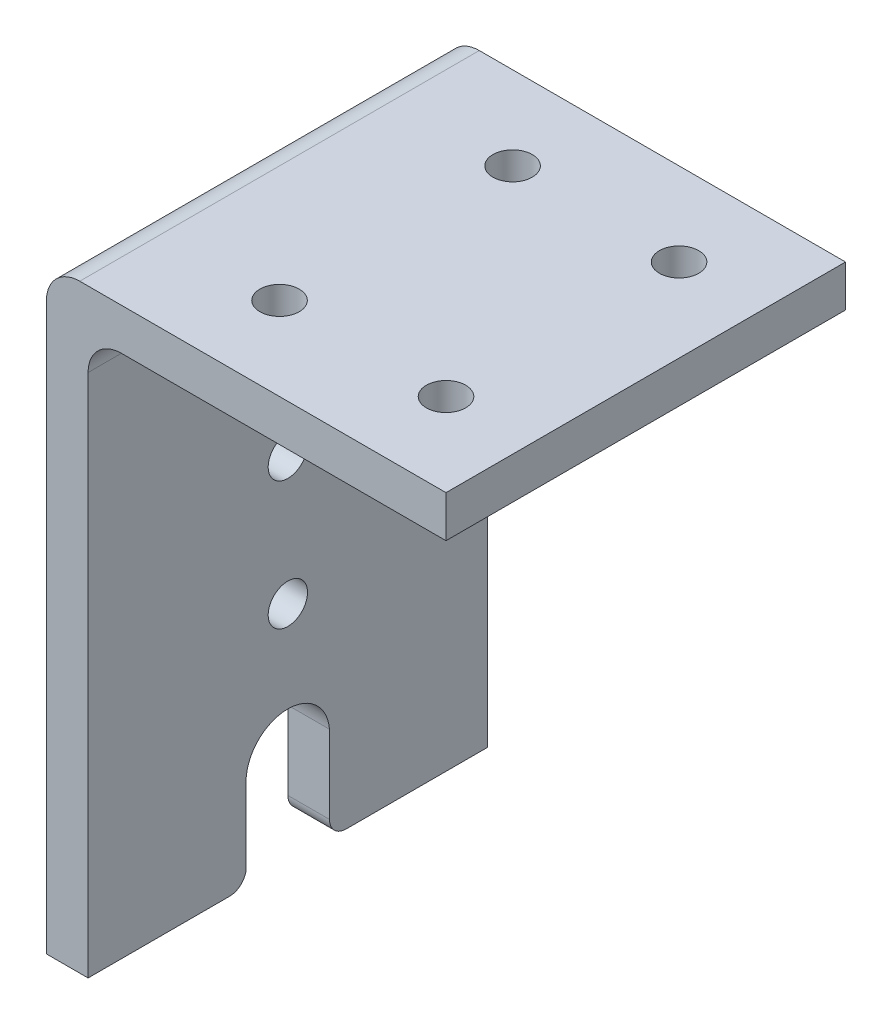
ISO-10303-21;
HEADER;
FILE_DESCRIPTION(('STEP AP214'),'2;1');
FILE_NAME('part.step','',(''),(''),'','','');
FILE_SCHEMA(('AUTOMOTIVE_DESIGN { 1 0 10303 214 1 1 1 1 }'));
ENDSEC;
DATA;
#1=APPLICATION_CONTEXT('core data for automotive mechanical design processes');
#2=APPLICATION_PROTOCOL_DEFINITION('international standard','automotive_design',2000,#1);
#3=PRODUCT_CONTEXT('',#1,'mechanical');
#4=PRODUCT('Part','Part','',(#3));
#5=PRODUCT_RELATED_PRODUCT_CATEGORY('part','',(#4));
#6=PRODUCT_DEFINITION_FORMATION('','',#4);
#7=PRODUCT_DEFINITION_CONTEXT('part definition',#1,'design');
#8=PRODUCT_DEFINITION('design','',#6,#7);
#9=PRODUCT_DEFINITION_SHAPE('','',#8);
#10=(LENGTH_UNIT() NAMED_UNIT(*) SI_UNIT(.MILLI.,.METRE.));
#11=(NAMED_UNIT(*) PLANE_ANGLE_UNIT() SI_UNIT($,.RADIAN.));
#12=(NAMED_UNIT(*) SI_UNIT($,.STERADIAN.) SOLID_ANGLE_UNIT());
#13=UNCERTAINTY_MEASURE_WITH_UNIT(LENGTH_MEASURE(1.E-05),#10,'distance_accuracy_value','');
#14=(GEOMETRIC_REPRESENTATION_CONTEXT(3) GLOBAL_UNCERTAINTY_ASSIGNED_CONTEXT((#13)) GLOBAL_UNIT_ASSIGNED_CONTEXT((#10,
#11,#12)) REPRESENTATION_CONTEXT('',''));
#15=CARTESIAN_POINT('',(0.,0.,0.));
#16=DIRECTION('',(0.,0.,1.));
#17=DIRECTION('',(1.,0.,0.));
#18=AXIS2_PLACEMENT_3D('',#15,#16,#17);
#19=CARTESIAN_POINT('',(-1.58749999999999,-42.545,30.48));
#20=DIRECTION('',(0.,1.,0.));
#21=DIRECTION('',(0.,0.,1.));
#22=AXIS2_PLACEMENT_3D('',#19,#20,#21);
#23=PLANE('',#22);
#24=DIRECTION('',(0.,0.,-1.));
#25=VECTOR('',#24,1.);
#26=CARTESIAN_POINT('',(1.58750000000001,-42.545,30.48));
#27=LINE('',#26,#25);
#28=CARTESIAN_POINT('',(1.58750000000001,-42.545,10.795));
#29=VERTEX_POINT('',#28);
#30=CARTESIAN_POINT('',(1.58750000000001,-42.545,0.));
#31=VERTEX_POINT('',#30);
#32=EDGE_CURVE('E278',#29,#31,#27,.T.);
#33=ORIENTED_EDGE('',*,*,#32,.F.);
#34=DIRECTION('',(1.,0.,0.));
#35=VECTOR('',#34,1.);
#36=CARTESIAN_POINT('',(-1.58749999999999,-42.545,10.795));
#37=LINE('',#36,#35);
#38=CARTESIAN_POINT('',(-1.58749999999999,-42.545,10.795));
#39=VERTEX_POINT('',#38);
#40=EDGE_CURVE('E321',#29,#39,#37,.F.);
#41=ORIENTED_EDGE('',*,*,#40,.T.);
#42=DIRECTION('',(0.,0.,-1.));
#43=VECTOR('',#42,1.);
#44=CARTESIAN_POINT('',(-1.58749999999999,-42.545,30.48));
#45=LINE('',#44,#43);
#46=CARTESIAN_POINT('',(-1.58749999999999,-42.545,0.));
#47=VERTEX_POINT('',#46);
#48=EDGE_CURVE('E282',#39,#47,#45,.T.);
#49=ORIENTED_EDGE('',*,*,#48,.T.);
#50=DIRECTION('',(1.,0.,0.));
#51=VECTOR('',#50,1.);
#52=CARTESIAN_POINT('',(-1.58749999999999,-42.545,0.));
#53=LINE('',#52,#51);
#54=EDGE_CURVE('E258',#47,#31,#53,.T.);
#55=ORIENTED_EDGE('',*,*,#54,.T.);
#56=EDGE_LOOP('',(#33,#41,#49,#55));
#57=FACE_BOUND('',#56,.T.);
#58=ADVANCED_FACE('F43',(#57),#23,.F.);
#59=CARTESIAN_POINT('',(28.8925,0.,30.48));
#60=DIRECTION('',(0.,1.,0.));
#61=DIRECTION('',(-1.,0.,0.));
#62=AXIS2_PLACEMENT_3D('',#59,#60,#61);
#63=PLANE('',#62);
#64=CARTESIAN_POINT('',(9.84249999999999,0.,6.35));
#65=DIRECTION('',(0.,-1.,0.));
#66=DIRECTION('',(0.,0.,-1.));
#67=AXIS2_PLACEMENT_3D('',#64,#65,#66);
#68=CIRCLE('',#67,1.5);
#69=CARTESIAN_POINT('',(9.84249999999999,0.,4.85));
#70=VERTEX_POINT('',#69);
#71=EDGE_CURVE('E188',#70,#70,#68,.T.);
#72=ORIENTED_EDGE('',*,*,#71,.F.);
#73=EDGE_LOOP('',(#72));
#74=FACE_BOUND('',#73,.T.);
#75=DIRECTION('',(1.,0.,0.));
#76=VECTOR('',#75,1.);
#77=CARTESIAN_POINT('',(28.8925,0.,30.48));
#78=LINE('',#77,#76);
#79=CARTESIAN_POINT('',(4.1275,0.,30.48));
#80=VERTEX_POINT('',#79);
#81=CARTESIAN_POINT('',(28.8925,0.,30.48));
#82=VERTEX_POINT('',#81);
#83=EDGE_CURVE('E244',#80,#82,#78,.T.);
#84=ORIENTED_EDGE('',*,*,#83,.F.);
#85=DIRECTION('',(0.,0.,-1.));
#86=VECTOR('',#85,1.);
#87=CARTESIAN_POINT('',(4.1275,0.,0.));
#88=LINE('',#87,#86);
#89=CARTESIAN_POINT('',(4.1275,0.,0.));
#90=VERTEX_POINT('',#89);
#91=EDGE_CURVE('E286',#80,#90,#88,.T.);
#92=ORIENTED_EDGE('',*,*,#91,.T.);
#93=DIRECTION('',(1.,0.,0.));
#94=VECTOR('',#93,1.);
#95=CARTESIAN_POINT('',(28.8925,0.,0.));
#96=LINE('',#95,#94);
#97=CARTESIAN_POINT('',(28.8925,0.,0.));
#98=VERTEX_POINT('',#97);
#99=EDGE_CURVE('E266',#90,#98,#96,.T.);
#100=ORIENTED_EDGE('',*,*,#99,.T.);
#101=DIRECTION('',(0.,0.,-1.));
#102=VECTOR('',#101,1.);
#103=CARTESIAN_POINT('',(28.8925,0.,30.48));
#104=LINE('',#103,#102);
#105=EDGE_CURVE('E274',#82,#98,#104,.T.);
#106=ORIENTED_EDGE('',*,*,#105,.F.);
#107=EDGE_LOOP('',(#84,#92,#100,#106));
#108=FACE_BOUND('',#107,.T.);
#109=CARTESIAN_POINT('',(22.5425,0.,24.13));
#110=DIRECTION('',(0.,-1.,0.));
#111=DIRECTION('',(0.,0.,-1.));
#112=AXIS2_PLACEMENT_3D('',#109,#110,#111);
#113=CIRCLE('',#112,1.5);
#114=CARTESIAN_POINT('',(22.5425,0.,22.63));
#115=VERTEX_POINT('',#114);
#116=EDGE_CURVE('E204',#115,#115,#113,.T.);
#117=ORIENTED_EDGE('',*,*,#116,.F.);
#118=EDGE_LOOP('',(#117));
#119=FACE_BOUND('',#118,.T.);
#120=CARTESIAN_POINT('',(9.84249999999999,0.,24.13));
#121=DIRECTION('',(0.,-1.,0.));
#122=DIRECTION('',(0.,0.,-1.));
#123=AXIS2_PLACEMENT_3D('',#120,#121,#122);
#124=CIRCLE('',#123,1.5);
#125=CARTESIAN_POINT('',(9.84249999999999,0.,22.63));
#126=VERTEX_POINT('',#125);
#127=EDGE_CURVE('E196',#126,#126,#124,.T.);
#128=ORIENTED_EDGE('',*,*,#127,.F.);
#129=EDGE_LOOP('',(#128));
#130=FACE_BOUND('',#129,.T.);
#131=CARTESIAN_POINT('',(22.5425,0.,6.35));
#132=DIRECTION('',(0.,-1.,0.));
#133=DIRECTION('',(0.,0.,-1.));
#134=AXIS2_PLACEMENT_3D('',#131,#132,#133);
#135=CIRCLE('',#134,1.5);
#136=CARTESIAN_POINT('',(22.5425,0.,4.85));
#137=VERTEX_POINT('',#136);
#138=EDGE_CURVE('E179',#137,#137,#135,.T.);
#139=ORIENTED_EDGE('',*,*,#138,.F.);
#140=EDGE_LOOP('',(#139));
#141=FACE_BOUND('',#140,.T.);
#142=ADVANCED_FACE('F347',(#74,#108,#119,#130,#141),#63,.F.);
#143=CARTESIAN_POINT('',(1.58750000000001,-42.545,30.48));
#144=DIRECTION('',(-1.,0.,0.));
#145=DIRECTION('',(0.,-1.,0.));
#146=AXIS2_PLACEMENT_3D('',#143,#144,#145);
#147=PLANE('',#146);
#148=DIRECTION('',(0.,1.,0.));
#149=VECTOR('',#148,1.);
#150=CARTESIAN_POINT('',(1.58750000000001,-42.545,12.065));
#151=LINE('',#150,#149);
#152=CARTESIAN_POINT('',(1.58750000000001,-41.275,12.065));
#153=VERTEX_POINT('',#152);
#154=CARTESIAN_POINT('',(1.58750000000001,-35.3175181257186,12.065));
#155=VERTEX_POINT('',#154);
#156=EDGE_CURVE('E153',#153,#155,#151,.T.);
#157=ORIENTED_EDGE('',*,*,#156,.F.);
#158=CARTESIAN_POINT('',(1.58750000000001,-41.275,10.795));
#159=DIRECTION('',(-1.,0.,0.));
#160=DIRECTION('',(0.,-1.,0.));
#161=AXIS2_PLACEMENT_3D('',#158,#159,#160);
#162=CIRCLE('',#161,1.27);
#163=EDGE_CURVE('E318',#153,#29,#162,.F.);
#164=ORIENTED_EDGE('',*,*,#163,.T.);
#165=ORIENTED_EDGE('',*,*,#32,.T.);
#166=DIRECTION('',(0.,1.,0.));
#167=VECTOR('',#166,1.);
#168=CARTESIAN_POINT('',(1.58750000000001,-42.545,0.));
#169=LINE('',#168,#167);
#170=CARTESIAN_POINT('',(1.5875,-2.54000000000001,0.));
#171=VERTEX_POINT('',#170);
#172=EDGE_CURVE('E262',#31,#171,#169,.T.);
#173=ORIENTED_EDGE('',*,*,#172,.T.);
#174=DIRECTION('',(0.,0.,-1.));
#175=VECTOR('',#174,1.);
#176=CARTESIAN_POINT('',(1.5875,-2.54000000000001,30.48));
#177=LINE('',#176,#175);
#178=CARTESIAN_POINT('',(1.5875,-2.54000000000001,30.48));
#179=VERTEX_POINT('',#178);
#180=EDGE_CURVE('E290',#171,#179,#177,.F.);
#181=ORIENTED_EDGE('',*,*,#180,.T.);
#182=DIRECTION('',(0.,1.,0.));
#183=VECTOR('',#182,1.);
#184=CARTESIAN_POINT('',(1.58750000000001,-42.545,30.48));
#185=LINE('',#184,#183);
#186=CARTESIAN_POINT('',(1.58750000000001,-42.545,30.48));
#187=VERTEX_POINT('',#186);
#188=EDGE_CURVE('E240',#187,#179,#185,.T.);
#189=ORIENTED_EDGE('',*,*,#188,.F.);
#190=CARTESIAN_POINT('',(1.58750000000001,-42.545,19.685));
#191=VERTEX_POINT('',#190);
#192=EDGE_CURVE('E279',#187,#191,#27,.T.);
#193=ORIENTED_EDGE('',*,*,#192,.T.);
#194=CARTESIAN_POINT('',(1.58750000000001,-41.275,19.685));
#195=DIRECTION('',(-1.,0.,0.));
#196=DIRECTION('',(0.,-1.,0.));
#197=AXIS2_PLACEMENT_3D('',#194,#195,#196);
#198=CIRCLE('',#197,1.27);
#199=CARTESIAN_POINT('',(1.58750000000001,-41.275,18.415));
#200=VERTEX_POINT('',#199);
#201=EDGE_CURVE('E167',#191,#200,#198,.F.);
#202=ORIENTED_EDGE('',*,*,#201,.T.);
#203=DIRECTION('',(0.,-1.,0.));
#204=VECTOR('',#203,1.);
#205=CARTESIAN_POINT('',(1.58750000000001,-42.545,18.415));
#206=LINE('',#205,#204);
#207=CARTESIAN_POINT('',(1.58750000000001,-35.3175181257186,18.415));
#208=VERTEX_POINT('',#207);
#209=EDGE_CURVE('E147',#208,#200,#206,.T.);
#210=ORIENTED_EDGE('',*,*,#209,.F.);
#211=CARTESIAN_POINT('',(1.58750000000001,-35.5700250802952,15.24));
#212=DIRECTION('',(1.,0.,0.));
#213=DIRECTION('',(0.,1.,0.));
#214=AXIS2_PLACEMENT_3D('',#211,#212,#213);
#215=CIRCLE('',#214,3.18502508029521);
#216=EDGE_CURVE('E157',#155,#208,#215,.T.);
#217=ORIENTED_EDGE('',*,*,#216,.F.);
#218=EDGE_LOOP('',(#157,#164,#165,#173,#181,#189,#193,#202,#210,#217));
#219=FACE_BOUND('',#218,.T.);
#220=CARTESIAN_POINT('',(1.5875,-15.6591,15.24));
#221=DIRECTION('',(1.,0.,0.));
#222=DIRECTION('',(0.,0.,-1.));
#223=AXIS2_PLACEMENT_3D('',#220,#221,#222);
#224=CIRCLE('',#223,1.5);
#225=CARTESIAN_POINT('',(1.5875,-15.6591,13.74));
#226=VERTEX_POINT('',#225);
#227=EDGE_CURVE('E220',#226,#226,#224,.T.);
#228=ORIENTED_EDGE('',*,*,#227,.F.);
#229=EDGE_LOOP('',(#228));
#230=FACE_BOUND('',#229,.T.);
#231=CARTESIAN_POINT('',(1.5875,-25.4381,15.24));
#232=DIRECTION('',(1.,0.,0.));
#233=DIRECTION('',(0.,0.,-1.));
#234=AXIS2_PLACEMENT_3D('',#231,#232,#233);
#235=CIRCLE('',#234,1.5);
#236=CARTESIAN_POINT('',(1.5875,-25.4381,13.74));
#237=VERTEX_POINT('',#236);
#238=EDGE_CURVE('E212',#237,#237,#235,.T.);
#239=ORIENTED_EDGE('',*,*,#238,.F.);
#240=EDGE_LOOP('',(#239));
#241=FACE_BOUND('',#240,.T.);
#242=ADVANCED_FACE('F164',(#219,#230,#241),#147,.F.);
#243=CARTESIAN_POINT('',(-1.5875,3.17500000000001,30.48));
#244=DIRECTION('',(0.,-1.,0.));
#245=DIRECTION('',(1.,0.,0.));
#246=AXIS2_PLACEMENT_3D('',#243,#244,#245);
#247=PLANE('',#246);
#248=CARTESIAN_POINT('',(22.5425,3.175,6.35));
#249=DIRECTION('',(0.,-1.,0.));
#250=DIRECTION('',(1.,0.,0.));
#251=AXIS2_PLACEMENT_3D('',#248,#249,#250);
#252=CIRCLE('',#251,1.5);
#253=CARTESIAN_POINT('',(24.0425,3.175,6.35));
#254=VERTEX_POINT('',#253);
#255=EDGE_CURVE('E184',#254,#254,#252,.T.);
#256=ORIENTED_EDGE('',*,*,#255,.T.);
#257=EDGE_LOOP('',(#256));
#258=FACE_BOUND('',#257,.T.);
#259=CARTESIAN_POINT('',(9.84249999999999,3.175,6.35));
#260=DIRECTION('',(0.,-1.,0.));
#261=DIRECTION('',(1.,0.,0.));
#262=AXIS2_PLACEMENT_3D('',#259,#260,#261);
#263=CIRCLE('',#262,1.5);
#264=CARTESIAN_POINT('',(11.3425,3.175,6.35));
#265=VERTEX_POINT('',#264);
#266=EDGE_CURVE('E192',#265,#265,#263,.T.);
#267=ORIENTED_EDGE('',*,*,#266,.T.);
#268=EDGE_LOOP('',(#267));
#269=FACE_BOUND('',#268,.T.);
#270=CARTESIAN_POINT('',(9.84249999999999,3.175,24.13));
#271=DIRECTION('',(0.,-1.,0.));
#272=DIRECTION('',(1.,0.,0.));
#273=AXIS2_PLACEMENT_3D('',#270,#271,#272);
#274=CIRCLE('',#273,1.5);
#275=CARTESIAN_POINT('',(11.3425,3.175,24.13));
#276=VERTEX_POINT('',#275);
#277=EDGE_CURVE('E200',#276,#276,#274,.T.);
#278=ORIENTED_EDGE('',*,*,#277,.T.);
#279=EDGE_LOOP('',(#278));
#280=FACE_BOUND('',#279,.T.);
#281=CARTESIAN_POINT('',(22.5425,3.175,24.13));
#282=DIRECTION('',(0.,-1.,0.));
#283=DIRECTION('',(1.,0.,0.));
#284=AXIS2_PLACEMENT_3D('',#281,#282,#283);
#285=CIRCLE('',#284,1.5);
#286=CARTESIAN_POINT('',(24.0425,3.175,24.13));
#287=VERTEX_POINT('',#286);
#288=EDGE_CURVE('E208',#287,#287,#285,.T.);
#289=ORIENTED_EDGE('',*,*,#288,.T.);
#290=EDGE_LOOP('',(#289));
#291=FACE_BOUND('',#290,.T.);
#292=DIRECTION('',(-1.,0.,0.));
#293=VECTOR('',#292,1.);
#294=CARTESIAN_POINT('',(-1.5875,3.17500000000001,0.));
#295=LINE('',#294,#293);
#296=CARTESIAN_POINT('',(28.8925,3.175,0.));
#297=VERTEX_POINT('',#296);
#298=CARTESIAN_POINT('',(0.952500000000001,3.17500000000001,0.));
#299=VERTEX_POINT('',#298);
#300=EDGE_CURVE('E228',#297,#299,#295,.T.);
#301=ORIENTED_EDGE('',*,*,#300,.T.);
#302=DIRECTION('',(0.,0.,-1.));
#303=VECTOR('',#302,1.);
#304=CARTESIAN_POINT('',(0.952500000000001,3.17500000000001,30.48));
#305=LINE('',#304,#303);
#306=CARTESIAN_POINT('',(0.952500000000001,3.17500000000001,30.48));
#307=VERTEX_POINT('',#306);
#308=EDGE_CURVE('E300',#299,#307,#305,.F.);
#309=ORIENTED_EDGE('',*,*,#308,.T.);
#310=DIRECTION('',(-1.,0.,0.));
#311=VECTOR('',#310,1.);
#312=CARTESIAN_POINT('',(-1.5875,3.17500000000001,30.48));
#313=LINE('',#312,#311);
#314=CARTESIAN_POINT('',(28.8925,3.175,30.48));
#315=VERTEX_POINT('',#314);
#316=EDGE_CURVE('E229',#315,#307,#313,.T.);
#317=ORIENTED_EDGE('',*,*,#316,.F.);
#318=DIRECTION('',(0.,0.,-1.));
#319=VECTOR('',#318,1.);
#320=CARTESIAN_POINT('',(28.8925,3.175,30.48));
#321=LINE('',#320,#319);
#322=EDGE_CURVE('E250',#315,#297,#321,.T.);
#323=ORIENTED_EDGE('',*,*,#322,.T.);
#324=EDGE_LOOP('',(#301,#309,#317,#323));
#325=FACE_BOUND('',#324,.T.);
#326=ADVANCED_FACE('F362',(#258,#269,#280,#291,#325),#247,.F.);
#327=CARTESIAN_POINT('',(-1.5875,3.17500000000001,30.48));
#328=DIRECTION('',(1.,0.,0.));
#329=DIRECTION('',(0.,1.,0.));
#330=AXIS2_PLACEMENT_3D('',#327,#328,#329);
#331=PLANE('',#330);
#332=CARTESIAN_POINT('',(-1.58749999999999,-25.4381,15.24));
#333=DIRECTION('',(1.,0.,0.));
#334=DIRECTION('',(0.,1.,0.));
#335=AXIS2_PLACEMENT_3D('',#332,#333,#334);
#336=CIRCLE('',#335,1.5);
#337=CARTESIAN_POINT('',(-1.58749999999999,-23.9381,15.24));
#338=VERTEX_POINT('',#337);
#339=EDGE_CURVE('E216',#338,#338,#336,.T.);
#340=ORIENTED_EDGE('',*,*,#339,.T.);
#341=EDGE_LOOP('',(#340));
#342=FACE_BOUND('',#341,.T.);
#343=CARTESIAN_POINT('',(-1.58749999999999,-15.6591,15.24));
#344=DIRECTION('',(1.,0.,0.));
#345=DIRECTION('',(0.,1.,0.));
#346=AXIS2_PLACEMENT_3D('',#343,#344,#345);
#347=CIRCLE('',#346,1.5);
#348=CARTESIAN_POINT('',(-1.58749999999999,-14.1591,15.24));
#349=VERTEX_POINT('',#348);
#350=EDGE_CURVE('E224',#349,#349,#347,.T.);
#351=ORIENTED_EDGE('',*,*,#350,.T.);
#352=EDGE_LOOP('',(#351));
#353=FACE_BOUND('',#352,.T.);
#354=ORIENTED_EDGE('',*,*,#48,.F.);
#355=CARTESIAN_POINT('',(-1.58749999999998,-41.275,10.795));
#356=DIRECTION('',(1.,0.,0.));
#357=DIRECTION('',(0.,1.,0.));
#358=AXIS2_PLACEMENT_3D('',#355,#356,#357);
#359=CIRCLE('',#358,1.27);
#360=CARTESIAN_POINT('',(-1.58749999999999,-41.275,12.065));
#361=VERTEX_POINT('',#360);
#362=EDGE_CURVE('E326',#39,#361,#359,.F.);
#363=ORIENTED_EDGE('',*,*,#362,.T.);
#364=DIRECTION('',(0.,-1.,0.));
#365=VECTOR('',#364,1.);
#366=CARTESIAN_POINT('',(-1.58749999999998,-42.545,12.065));
#367=LINE('',#366,#365);
#368=CARTESIAN_POINT('',(-1.58749999999999,-35.3175181257186,12.065));
#369=VERTEX_POINT('',#368);
#370=EDGE_CURVE('E175',#369,#361,#367,.T.);
#371=ORIENTED_EDGE('',*,*,#370,.F.);
#372=CARTESIAN_POINT('',(-1.58749999999999,-35.5700250802952,15.24));
#373=DIRECTION('',(1.,0.,0.));
#374=DIRECTION('',(0.,1.,0.));
#375=AXIS2_PLACEMENT_3D('',#372,#373,#374);
#376=CIRCLE('',#375,3.18502508029521);
#377=CARTESIAN_POINT('',(-1.58749999999999,-35.3175181257186,18.415));
#378=VERTEX_POINT('',#377);
#379=EDGE_CURVE('E180',#378,#369,#376,.F.);
#380=ORIENTED_EDGE('',*,*,#379,.F.);
#381=DIRECTION('',(0.,1.,0.));
#382=VECTOR('',#381,1.);
#383=CARTESIAN_POINT('',(-1.58749999999998,-42.545,18.415));
#384=LINE('',#383,#382);
#385=CARTESIAN_POINT('',(-1.58749999999999,-41.275,18.415));
#386=VERTEX_POINT('',#385);
#387=EDGE_CURVE('E148',#386,#378,#384,.T.);
#388=ORIENTED_EDGE('',*,*,#387,.F.);
#389=CARTESIAN_POINT('',(-1.58749999999999,-41.275,19.685));
#390=DIRECTION('',(1.,0.,0.));
#391=DIRECTION('',(0.,1.,0.));
#392=AXIS2_PLACEMENT_3D('',#389,#390,#391);
#393=CIRCLE('',#392,1.27);
#394=CARTESIAN_POINT('',(-1.58749999999999,-42.545,19.685));
#395=VERTEX_POINT('',#394);
#396=EDGE_CURVE('E59',#386,#395,#393,.F.);
#397=ORIENTED_EDGE('',*,*,#396,.T.);
#398=CARTESIAN_POINT('',(-1.58749999999999,-42.545,30.48));
#399=VERTEX_POINT('',#398);
#400=EDGE_CURVE('E283',#399,#395,#45,.T.);
#401=ORIENTED_EDGE('',*,*,#400,.F.);
#402=DIRECTION('',(0.,-1.,0.));
#403=VECTOR('',#402,1.);
#404=CARTESIAN_POINT('',(-1.5875,3.17500000000001,30.48));
#405=LINE('',#404,#403);
#406=CARTESIAN_POINT('',(-1.5875,0.635000000000005,30.48));
#407=VERTEX_POINT('',#406);
#408=EDGE_CURVE('E233',#407,#399,#405,.T.);
#409=ORIENTED_EDGE('',*,*,#408,.F.);
#410=DIRECTION('',(0.,0.,-1.));
#411=VECTOR('',#410,1.);
#412=CARTESIAN_POINT('',(-1.5875,0.635000000000005,30.48));
#413=LINE('',#412,#411);
#414=CARTESIAN_POINT('',(-1.5875,0.635000000000005,0.));
#415=VERTEX_POINT('',#414);
#416=EDGE_CURVE('E293',#407,#415,#413,.T.);
#417=ORIENTED_EDGE('',*,*,#416,.T.);
#418=DIRECTION('',(0.,-1.,0.));
#419=VECTOR('',#418,1.);
#420=CARTESIAN_POINT('',(-1.5875,3.17500000000001,0.));
#421=LINE('',#420,#419);
#422=EDGE_CURVE('E254',#415,#47,#421,.T.);
#423=ORIENTED_EDGE('',*,*,#422,.T.);
#424=EDGE_LOOP('',(#354,#363,#371,#380,#388,#397,#401,#409,#417,#423));
#425=FACE_BOUND('',#424,.T.);
#426=ADVANCED_FACE('F370',(#342,#353,#425),#331,.F.);
#427=ORIENTED_EDGE('',*,*,#400,.T.);
#428=DIRECTION('',(1.,0.,0.));
#429=VECTOR('',#428,1.);
#430=CARTESIAN_POINT('',(-1.58749999999999,-42.545,19.685));
#431=LINE('',#430,#429);
#432=EDGE_CURVE('E52',#395,#191,#431,.T.);
#433=ORIENTED_EDGE('',*,*,#432,.T.);
#434=ORIENTED_EDGE('',*,*,#192,.F.);
#435=DIRECTION('',(1.,0.,0.));
#436=VECTOR('',#435,1.);
#437=CARTESIAN_POINT('',(-1.58749999999999,-42.545,30.48));
#438=LINE('',#437,#436);
#439=EDGE_CURVE('E237',#399,#187,#438,.T.);
#440=ORIENTED_EDGE('',*,*,#439,.F.);
#441=EDGE_LOOP('',(#427,#433,#434,#440));
#442=FACE_BOUND('',#441,.T.);
#443=ADVANCED_FACE('F333',(#442),#23,.F.);
#444=CARTESIAN_POINT('',(28.8925,3.175,30.48));
#445=DIRECTION('',(-1.,0.,0.));
#446=DIRECTION('',(0.,0.,1.));
#447=AXIS2_PLACEMENT_3D('',#444,#445,#446);
#448=PLANE('',#447);
#449=DIRECTION('',(0.,1.,0.));
#450=VECTOR('',#449,1.);
#451=CARTESIAN_POINT('',(28.8925,3.175,0.));
#452=LINE('',#451,#450);
#453=EDGE_CURVE('E234',#98,#297,#452,.T.);
#454=ORIENTED_EDGE('',*,*,#453,.T.);
#455=ORIENTED_EDGE('',*,*,#322,.F.);
#456=DIRECTION('',(0.,1.,0.));
#457=VECTOR('',#456,1.);
#458=CARTESIAN_POINT('',(28.8925,3.175,30.48));
#459=LINE('',#458,#457);
#460=EDGE_CURVE('E247',#82,#315,#459,.T.);
#461=ORIENTED_EDGE('',*,*,#460,.F.);
#462=ORIENTED_EDGE('',*,*,#105,.T.);
#463=EDGE_LOOP('',(#454,#455,#461,#462));
#464=FACE_BOUND('',#463,.T.);
#465=ADVANCED_FACE('F358',(#464),#448,.F.);
#466=CARTESIAN_POINT('',(0.,0.,30.48));
#467=DIRECTION('',(0.,0.,-1.));
#468=DIRECTION('',(-1.,0.,0.));
#469=AXIS2_PLACEMENT_3D('',#466,#467,#468);
#470=PLANE('',#469);
#471=ORIENTED_EDGE('',*,*,#316,.T.);
#472=CARTESIAN_POINT('',(0.952500000000001,0.635000000000006,30.48));
#473=DIRECTION('',(0.,0.,-1.));
#474=DIRECTION('',(-1.,0.,0.));
#475=AXIS2_PLACEMENT_3D('',#472,#473,#474);
#476=CIRCLE('',#475,2.54);
#477=EDGE_CURVE('E303',#307,#407,#476,.F.);
#478=ORIENTED_EDGE('',*,*,#477,.T.);
#479=ORIENTED_EDGE('',*,*,#408,.T.);
#480=ORIENTED_EDGE('',*,*,#439,.T.);
#481=ORIENTED_EDGE('',*,*,#188,.T.);
#482=CARTESIAN_POINT('',(4.1275,-2.54000000000001,30.48));
#483=DIRECTION('',(0.,0.,-1.));
#484=DIRECTION('',(-1.,0.,0.));
#485=AXIS2_PLACEMENT_3D('',#482,#483,#484);
#486=CIRCLE('',#485,2.54);
#487=EDGE_CURVE('E309',#179,#80,#486,.T.);
#488=ORIENTED_EDGE('',*,*,#487,.T.);
#489=ORIENTED_EDGE('',*,*,#83,.T.);
#490=ORIENTED_EDGE('',*,*,#460,.T.);
#491=EDGE_LOOP('',(#471,#478,#479,#480,#481,#488,#489,#490));
#492=FACE_BOUND('',#491,.T.);
#493=ADVANCED_FACE('F340',(#492),#470,.F.);
#494=CARTESIAN_POINT('',(0.,0.,0.));
#495=DIRECTION('',(0.,0.,-1.));
#496=DIRECTION('',(-1.,0.,0.));
#497=AXIS2_PLACEMENT_3D('',#494,#495,#496);
#498=PLANE('',#497);
#499=ORIENTED_EDGE('',*,*,#422,.F.);
#500=CARTESIAN_POINT('',(0.952500000000001,0.635000000000006,0.));
#501=DIRECTION('',(0.,0.,-1.));
#502=DIRECTION('',(-1.,0.,0.));
#503=AXIS2_PLACEMENT_3D('',#500,#501,#502);
#504=CIRCLE('',#503,2.54);
#505=EDGE_CURVE('E297',#415,#299,#504,.T.);
#506=ORIENTED_EDGE('',*,*,#505,.T.);
#507=ORIENTED_EDGE('',*,*,#300,.F.);
#508=ORIENTED_EDGE('',*,*,#453,.F.);
#509=ORIENTED_EDGE('',*,*,#99,.F.);
#510=CARTESIAN_POINT('',(4.1275,-2.54000000000001,0.));
#511=DIRECTION('',(0.,0.,-1.));
#512=DIRECTION('',(-1.,0.,0.));
#513=AXIS2_PLACEMENT_3D('',#510,#511,#512);
#514=CIRCLE('',#513,2.54);
#515=EDGE_CURVE('E306',#90,#171,#514,.F.);
#516=ORIENTED_EDGE('',*,*,#515,.T.);
#517=ORIENTED_EDGE('',*,*,#172,.F.);
#518=ORIENTED_EDGE('',*,*,#54,.F.);
#519=EDGE_LOOP('',(#499,#506,#507,#508,#509,#516,#517,#518));
#520=FACE_BOUND('',#519,.T.);
#521=ADVANCED_FACE('F353',(#520),#498,.T.);
#522=CARTESIAN_POINT('',(4.1275,-2.54000000000001,30.48));
#523=DIRECTION('',(0.,0.,1.));
#524=DIRECTION('',(1.,0.,0.));
#525=AXIS2_PLACEMENT_3D('',#522,#523,#524);
#526=CYLINDRICAL_SURFACE('',#525,2.54);
#527=ORIENTED_EDGE('',*,*,#487,.F.);
#528=ORIENTED_EDGE('',*,*,#180,.F.);
#529=ORIENTED_EDGE('',*,*,#515,.F.);
#530=ORIENTED_EDGE('',*,*,#91,.F.);
#531=EDGE_LOOP('',(#527,#528,#529,#530));
#532=FACE_BOUND('',#531,.T.);
#533=ADVANCED_FACE('F344',(#532),#526,.F.);
#534=CARTESIAN_POINT('',(0.952500000000001,0.635000000000006,30.48));
#535=DIRECTION('',(0.,0.,-1.));
#536=DIRECTION('',(-1.,0.,0.));
#537=AXIS2_PLACEMENT_3D('',#534,#535,#536);
#538=CYLINDRICAL_SURFACE('',#537,2.54);
#539=ORIENTED_EDGE('',*,*,#477,.F.);
#540=ORIENTED_EDGE('',*,*,#308,.F.);
#541=ORIENTED_EDGE('',*,*,#505,.F.);
#542=ORIENTED_EDGE('',*,*,#416,.F.);
#543=EDGE_LOOP('',(#539,#540,#541,#542));
#544=FACE_BOUND('',#543,.T.);
#545=ADVANCED_FACE('F368',(#544),#538,.T.);
#546=CARTESIAN_POINT('',(1.5875,-15.6591,15.24));
#547=DIRECTION('',(1.,0.,0.));
#548=DIRECTION('',(0.,0.,-1.));
#549=AXIS2_PLACEMENT_3D('',#546,#547,#548);
#550=CYLINDRICAL_SURFACE('',#549,1.5);
#551=ORIENTED_EDGE('',*,*,#350,.F.);
#552=EDGE_LOOP('',(#551));
#553=FACE_BOUND('',#552,.T.);
#554=ORIENTED_EDGE('',*,*,#227,.T.);
#555=EDGE_LOOP('',(#554));
#556=FACE_BOUND('',#555,.T.);
#557=ADVANCED_FACE('F420',(#553,#556),#550,.F.);
#558=CARTESIAN_POINT('',(1.5875,-25.4381,15.24));
#559=DIRECTION('',(1.,0.,0.));
#560=DIRECTION('',(0.,0.,-1.));
#561=AXIS2_PLACEMENT_3D('',#558,#559,#560);
#562=CYLINDRICAL_SURFACE('',#561,1.5);
#563=ORIENTED_EDGE('',*,*,#339,.F.);
#564=EDGE_LOOP('',(#563));
#565=FACE_BOUND('',#564,.T.);
#566=ORIENTED_EDGE('',*,*,#238,.T.);
#567=EDGE_LOOP('',(#566));
#568=FACE_BOUND('',#567,.T.);
#569=ADVANCED_FACE('F424',(#565,#568),#562,.F.);
#570=CARTESIAN_POINT('',(22.5425,0.,24.13));
#571=DIRECTION('',(0.,-1.,0.));
#572=DIRECTION('',(0.,0.,-1.));
#573=AXIS2_PLACEMENT_3D('',#570,#571,#572);
#574=CYLINDRICAL_SURFACE('',#573,1.5);
#575=ORIENTED_EDGE('',*,*,#288,.F.);
#576=EDGE_LOOP('',(#575));
#577=FACE_BOUND('',#576,.T.);
#578=ORIENTED_EDGE('',*,*,#116,.T.);
#579=EDGE_LOOP('',(#578));
#580=FACE_BOUND('',#579,.T.);
#581=ADVANCED_FACE('F430',(#577,#580),#574,.F.);
#582=CARTESIAN_POINT('',(9.84249999999999,0.,24.13));
#583=DIRECTION('',(0.,-1.,0.));
#584=DIRECTION('',(0.,0.,-1.));
#585=AXIS2_PLACEMENT_3D('',#582,#583,#584);
#586=CYLINDRICAL_SURFACE('',#585,1.5);
#587=ORIENTED_EDGE('',*,*,#277,.F.);
#588=EDGE_LOOP('',(#587));
#589=FACE_BOUND('',#588,.T.);
#590=ORIENTED_EDGE('',*,*,#127,.T.);
#591=EDGE_LOOP('',(#590));
#592=FACE_BOUND('',#591,.T.);
#593=ADVANCED_FACE('F463',(#589,#592),#586,.F.);
#594=CARTESIAN_POINT('',(9.84249999999999,0.,6.35));
#595=DIRECTION('',(0.,-1.,0.));
#596=DIRECTION('',(0.,0.,-1.));
#597=AXIS2_PLACEMENT_3D('',#594,#595,#596);
#598=CYLINDRICAL_SURFACE('',#597,1.5);
#599=ORIENTED_EDGE('',*,*,#266,.F.);
#600=EDGE_LOOP('',(#599));
#601=FACE_BOUND('',#600,.T.);
#602=ORIENTED_EDGE('',*,*,#71,.T.);
#603=EDGE_LOOP('',(#602));
#604=FACE_BOUND('',#603,.T.);
#605=ADVANCED_FACE('F474',(#601,#604),#598,.F.);
#606=CARTESIAN_POINT('',(22.5425,0.,6.35));
#607=DIRECTION('',(0.,-1.,0.));
#608=DIRECTION('',(0.,0.,-1.));
#609=AXIS2_PLACEMENT_3D('',#606,#607,#608);
#610=CYLINDRICAL_SURFACE('',#609,1.5);
#611=ORIENTED_EDGE('',*,*,#255,.F.);
#612=EDGE_LOOP('',(#611));
#613=FACE_BOUND('',#612,.T.);
#614=ORIENTED_EDGE('',*,*,#138,.T.);
#615=EDGE_LOOP('',(#614));
#616=FACE_BOUND('',#615,.T.);
#617=ADVANCED_FACE('F485',(#613,#616),#610,.F.);
#618=CARTESIAN_POINT('',(-13.5686560377119,-35.5700250802952,15.24));
#619=DIRECTION('',(1.,0.,0.));
#620=DIRECTION('',(0.,1.,0.));
#621=AXIS2_PLACEMENT_3D('',#618,#619,#620);
#622=CYLINDRICAL_SURFACE('',#621,3.18502508029521);
#623=ORIENTED_EDGE('',*,*,#379,.T.);
#624=DIRECTION('',(1.,0.,0.));
#625=VECTOR('',#624,1.);
#626=CARTESIAN_POINT('',(-13.5686560377119,-35.3175181257186,12.065));
#627=LINE('',#626,#625);
#628=EDGE_CURVE('E152',#369,#155,#627,.T.);
#629=ORIENTED_EDGE('',*,*,#628,.T.);
#630=ORIENTED_EDGE('',*,*,#216,.T.);
#631=DIRECTION('',(1.,0.,0.));
#632=VECTOR('',#631,1.);
#633=CARTESIAN_POINT('',(-13.5686560377119,-35.3175181257186,18.415));
#634=LINE('',#633,#632);
#635=EDGE_CURVE('E143',#378,#208,#634,.T.);
#636=ORIENTED_EDGE('',*,*,#635,.F.);
#637=EDGE_LOOP('',(#623,#629,#630,#636));
#638=FACE_BOUND('',#637,.T.);
#639=ADVANCED_FACE('F158',(#638),#622,.F.);
#640=CARTESIAN_POINT('',(-13.5686560377119,-42.545,12.065));
#641=DIRECTION('',(0.,0.,-1.));
#642=DIRECTION('',(0.,1.,0.));
#643=AXIS2_PLACEMENT_3D('',#640,#641,#642);
#644=PLANE('',#643);
#645=ORIENTED_EDGE('',*,*,#370,.T.);
#646=DIRECTION('',(1.,0.,0.));
#647=VECTOR('',#646,1.);
#648=CARTESIAN_POINT('',(-13.5686560377119,-41.275,12.065));
#649=LINE('',#648,#647);
#650=EDGE_CURVE('E312',#361,#153,#649,.T.);
#651=ORIENTED_EDGE('',*,*,#650,.T.);
#652=ORIENTED_EDGE('',*,*,#156,.T.);
#653=ORIENTED_EDGE('',*,*,#628,.F.);
#654=EDGE_LOOP('',(#645,#651,#652,#653));
#655=FACE_BOUND('',#654,.T.);
#656=ADVANCED_FACE('F385',(#655),#644,.F.);
#657=CARTESIAN_POINT('',(-13.5686560377119,-42.545,18.415));
#658=DIRECTION('',(0.,0.,1.));
#659=DIRECTION('',(1.,0.,0.));
#660=AXIS2_PLACEMENT_3D('',#657,#658,#659);
#661=PLANE('',#660);
#662=ORIENTED_EDGE('',*,*,#209,.T.);
#663=DIRECTION('',(1.,0.,0.));
#664=VECTOR('',#663,1.);
#665=CARTESIAN_POINT('',(-13.5686560377119,-41.275,18.415));
#666=LINE('',#665,#664);
#667=EDGE_CURVE('E11',#200,#386,#666,.F.);
#668=ORIENTED_EDGE('',*,*,#667,.T.);
#669=ORIENTED_EDGE('',*,*,#387,.T.);
#670=ORIENTED_EDGE('',*,*,#635,.T.);
#671=EDGE_LOOP('',(#662,#668,#669,#670));
#672=FACE_BOUND('',#671,.T.);
#673=ADVANCED_FACE('F145',(#672),#661,.F.);
#674=CARTESIAN_POINT('',(-13.5686560377119,-41.275,10.795));
#675=DIRECTION('',(1.,0.,0.));
#676=DIRECTION('',(0.,0.,-1.));
#677=AXIS2_PLACEMENT_3D('',#674,#675,#676);
#678=CYLINDRICAL_SURFACE('',#677,1.27);
#679=ORIENTED_EDGE('',*,*,#362,.F.);
#680=ORIENTED_EDGE('',*,*,#40,.F.);
#681=ORIENTED_EDGE('',*,*,#163,.F.);
#682=ORIENTED_EDGE('',*,*,#650,.F.);
#683=EDGE_LOOP('',(#679,#680,#681,#682));
#684=FACE_BOUND('',#683,.T.);
#685=ADVANCED_FACE('F387',(#684),#678,.T.);
#686=CARTESIAN_POINT('',(-1.58749999999999,-41.275,19.685));
#687=DIRECTION('',(1.,0.,0.));
#688=DIRECTION('',(0.,0.,-1.));
#689=AXIS2_PLACEMENT_3D('',#686,#687,#688);
#690=CYLINDRICAL_SURFACE('',#689,1.27);
#691=ORIENTED_EDGE('',*,*,#396,.F.);
#692=ORIENTED_EDGE('',*,*,#667,.F.);
#693=ORIENTED_EDGE('',*,*,#201,.F.);
#694=ORIENTED_EDGE('',*,*,#432,.F.);
#695=EDGE_LOOP('',(#691,#692,#693,#694));
#696=FACE_BOUND('',#695,.T.);
#697=ADVANCED_FACE('F45',(#696),#690,.T.);
#698=CLOSED_SHELL('',(#58,#142,#242,#326,#426,#443,#465,#493,#521,#533,#545,#557,#569,#581,#593,
#605,#617,#639,#656,#673,#685,#697));
#699=MANIFOLD_SOLID_BREP('B2',#698);
#700=ADVANCED_BREP_SHAPE_REPRESENTATION('',(#18,#699),#14);
#701=SHAPE_DEFINITION_REPRESENTATION(#9,#700);
ENDSEC;
END-ISO-10303-21;
